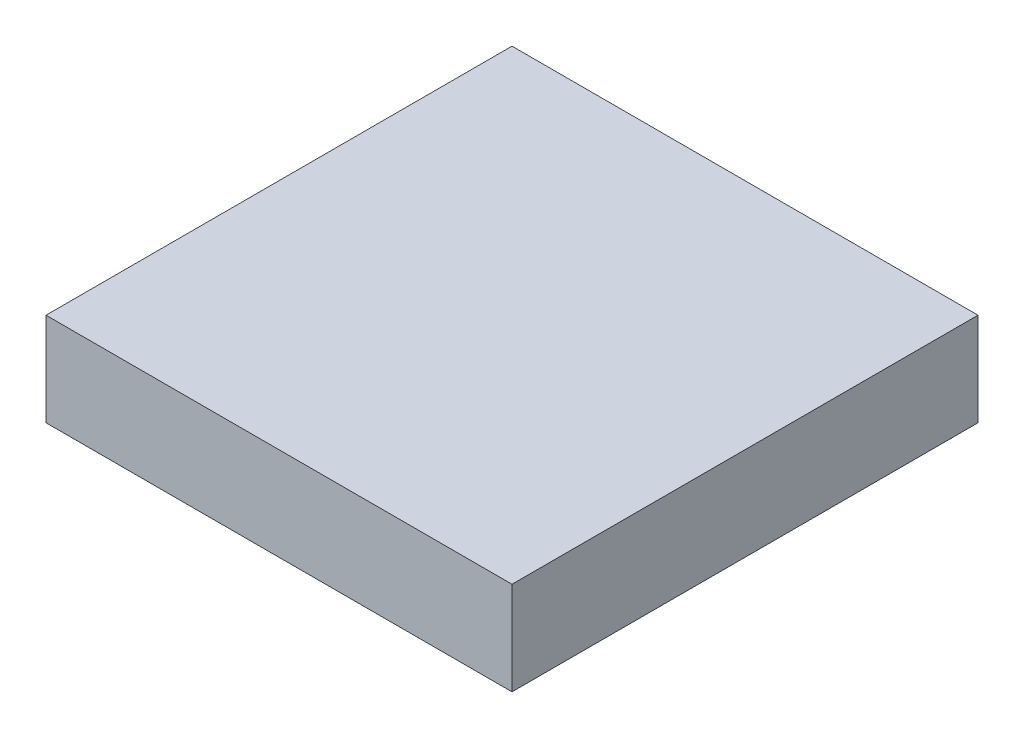
ISO-10303-21;
HEADER;
FILE_DESCRIPTION(('STEP AP214'),'2;1');
FILE_NAME('part.step','',(''),(''),'','','');
FILE_SCHEMA(('AUTOMOTIVE_DESIGN { 1 0 10303 214 1 1 1 1 }'));
ENDSEC;
DATA;
#1=APPLICATION_CONTEXT('core data for automotive mechanical design processes');
#2=APPLICATION_PROTOCOL_DEFINITION('international standard','automotive_design',2000,#1);
#3=PRODUCT_CONTEXT('',#1,'mechanical');
#4=PRODUCT('Part','Part','',(#3));
#5=PRODUCT_RELATED_PRODUCT_CATEGORY('part','',(#4));
#6=PRODUCT_DEFINITION_FORMATION('','',#4);
#7=PRODUCT_DEFINITION_CONTEXT('part definition',#1,'design');
#8=PRODUCT_DEFINITION('design','',#6,#7);
#9=PRODUCT_DEFINITION_SHAPE('','',#8);
#10=(LENGTH_UNIT() NAMED_UNIT(*) SI_UNIT(.MILLI.,.METRE.));
#11=(NAMED_UNIT(*) PLANE_ANGLE_UNIT() SI_UNIT($,.RADIAN.));
#12=(NAMED_UNIT(*) SI_UNIT($,.STERADIAN.) SOLID_ANGLE_UNIT());
#13=UNCERTAINTY_MEASURE_WITH_UNIT(LENGTH_MEASURE(1.E-05),#10,'distance_accuracy_value','');
#14=(GEOMETRIC_REPRESENTATION_CONTEXT(3) GLOBAL_UNCERTAINTY_ASSIGNED_CONTEXT((#13)) GLOBAL_UNIT_ASSIGNED_CONTEXT((#10,
#11,#12)) REPRESENTATION_CONTEXT('',''));
#15=CARTESIAN_POINT('',(0.,0.,0.));
#16=DIRECTION('',(0.,0.,1.));
#17=DIRECTION('',(1.,0.,0.));
#18=AXIS2_PLACEMENT_3D('',#15,#16,#17);
#19=CARTESIAN_POINT('',(-63.5,25.4,-63.5));
#20=DIRECTION('',(1.,0.,0.));
#21=DIRECTION('',(0.,0.,-1.));
#22=AXIS2_PLACEMENT_3D('',#19,#20,#21);
#23=PLANE('',#22);
#24=DIRECTION('',(0.,0.,1.));
#25=VECTOR('',#24,1.);
#26=CARTESIAN_POINT('',(-63.5,0.,-63.5));
#27=LINE('',#26,#25);
#28=CARTESIAN_POINT('',(-63.5,0.,-63.5));
#29=VERTEX_POINT('',#28);
#30=CARTESIAN_POINT('',(-63.5,0.,63.5));
#31=VERTEX_POINT('',#30);
#32=EDGE_CURVE('E95',#29,#31,#27,.T.);
#33=ORIENTED_EDGE('',*,*,#32,.T.);
#34=DIRECTION('',(0.,-1.,0.));
#35=VECTOR('',#34,1.);
#36=CARTESIAN_POINT('',(-63.5,25.4,63.5));
#37=LINE('',#36,#35);
#38=CARTESIAN_POINT('',(-63.5,25.4,63.5));
#39=VERTEX_POINT('',#38);
#40=EDGE_CURVE('E11',#39,#31,#37,.T.);
#41=ORIENTED_EDGE('',*,*,#40,.F.);
#42=DIRECTION('',(0.,0.,1.));
#43=VECTOR('',#42,1.);
#44=CARTESIAN_POINT('',(-63.5,25.4,-63.5));
#45=LINE('',#44,#43);
#46=CARTESIAN_POINT('',(-63.5,25.4,-63.5));
#47=VERTEX_POINT('',#46);
#48=EDGE_CURVE('E83',#47,#39,#45,.T.);
#49=ORIENTED_EDGE('',*,*,#48,.F.);
#50=DIRECTION('',(0.,-1.,0.));
#51=VECTOR('',#50,1.);
#52=CARTESIAN_POINT('',(-63.5,25.4,-63.5));
#53=LINE('',#52,#51);
#54=EDGE_CURVE('E91',#47,#29,#53,.T.);
#55=ORIENTED_EDGE('',*,*,#54,.T.);
#56=EDGE_LOOP('',(#33,#41,#49,#55));
#57=FACE_BOUND('',#56,.T.);
#58=ADVANCED_FACE('F32',(#57),#23,.F.);
#59=CARTESIAN_POINT('',(63.5,25.4,63.5));
#60=DIRECTION('',(0.,0.,-1.));
#61=DIRECTION('',(-1.,0.,0.));
#62=AXIS2_PLACEMENT_3D('',#59,#60,#61);
#63=PLANE('',#62);
#64=DIRECTION('',(1.,0.,0.));
#65=VECTOR('',#64,1.);
#66=CARTESIAN_POINT('',(63.5,0.,63.5));
#67=LINE('',#66,#65);
#68=CARTESIAN_POINT('',(63.5,0.,63.5));
#69=VERTEX_POINT('',#68);
#70=EDGE_CURVE('E87',#31,#69,#67,.T.);
#71=ORIENTED_EDGE('',*,*,#70,.T.);
#72=DIRECTION('',(0.,-1.,0.));
#73=VECTOR('',#72,1.);
#74=CARTESIAN_POINT('',(63.5,25.4,63.5));
#75=LINE('',#74,#73);
#76=CARTESIAN_POINT('',(63.5,25.4,63.5));
#77=VERTEX_POINT('',#76);
#78=EDGE_CURVE('E40',#77,#69,#75,.T.);
#79=ORIENTED_EDGE('',*,*,#78,.F.);
#80=DIRECTION('',(1.,0.,0.));
#81=VECTOR('',#80,1.);
#82=CARTESIAN_POINT('',(63.5,25.4,63.5));
#83=LINE('',#82,#81);
#84=EDGE_CURVE('E78',#39,#77,#83,.T.);
#85=ORIENTED_EDGE('',*,*,#84,.F.);
#86=ORIENTED_EDGE('',*,*,#40,.T.);
#87=EDGE_LOOP('',(#71,#79,#85,#86));
#88=FACE_BOUND('',#87,.T.);
#89=ADVANCED_FACE('F86',(#88),#63,.F.);
#90=CARTESIAN_POINT('',(63.5,25.4,-63.5));
#91=DIRECTION('',(-1.,0.,0.));
#92=DIRECTION('',(0.,0.,1.));
#93=AXIS2_PLACEMENT_3D('',#90,#91,#92);
#94=PLANE('',#93);
#95=DIRECTION('',(0.,0.,-1.));
#96=VECTOR('',#95,1.);
#97=CARTESIAN_POINT('',(63.5,0.,-63.5));
#98=LINE('',#97,#96);
#99=CARTESIAN_POINT('',(63.5,0.,-63.5));
#100=VERTEX_POINT('',#99);
#101=EDGE_CURVE('E65',#69,#100,#98,.T.);
#102=ORIENTED_EDGE('',*,*,#101,.T.);
#103=DIRECTION('',(0.,-1.,0.));
#104=VECTOR('',#103,1.);
#105=CARTESIAN_POINT('',(63.5,25.4,-63.5));
#106=LINE('',#105,#104);
#107=CARTESIAN_POINT('',(63.5,25.4,-63.5));
#108=VERTEX_POINT('',#107);
#109=EDGE_CURVE('E88',#108,#100,#106,.T.);
#110=ORIENTED_EDGE('',*,*,#109,.F.);
#111=DIRECTION('',(0.,0.,-1.));
#112=VECTOR('',#111,1.);
#113=CARTESIAN_POINT('',(63.5,25.4,-63.5));
#114=LINE('',#113,#112);
#115=EDGE_CURVE('E81',#77,#108,#114,.T.);
#116=ORIENTED_EDGE('',*,*,#115,.F.);
#117=ORIENTED_EDGE('',*,*,#78,.T.);
#118=EDGE_LOOP('',(#102,#110,#116,#117));
#119=FACE_BOUND('',#118,.T.);
#120=ADVANCED_FACE('F89',(#119),#94,.F.);
#121=CARTESIAN_POINT('',(63.5,25.4,-63.5));
#122=DIRECTION('',(0.,0.,1.));
#123=DIRECTION('',(1.,0.,0.));
#124=AXIS2_PLACEMENT_3D('',#121,#122,#123);
#125=PLANE('',#124);
#126=DIRECTION('',(-1.,0.,0.));
#127=VECTOR('',#126,1.);
#128=CARTESIAN_POINT('',(63.5,0.,-63.5));
#129=LINE('',#128,#127);
#130=EDGE_CURVE('E71',#100,#29,#129,.T.);
#131=ORIENTED_EDGE('',*,*,#130,.T.);
#132=ORIENTED_EDGE('',*,*,#54,.F.);
#133=DIRECTION('',(-1.,0.,0.));
#134=VECTOR('',#133,1.);
#135=CARTESIAN_POINT('',(63.5,25.4,-63.5));
#136=LINE('',#135,#134);
#137=EDGE_CURVE('E48',#108,#47,#136,.T.);
#138=ORIENTED_EDGE('',*,*,#137,.F.);
#139=ORIENTED_EDGE('',*,*,#109,.T.);
#140=EDGE_LOOP('',(#131,#132,#138,#139));
#141=FACE_BOUND('',#140,.T.);
#142=ADVANCED_FACE('F102',(#141),#125,.F.);
#143=CARTESIAN_POINT('',(0.,25.4,0.));
#144=DIRECTION('',(0.,-1.,0.));
#145=DIRECTION('',(0.,0.,-1.));
#146=AXIS2_PLACEMENT_3D('',#143,#144,#145);
#147=PLANE('',#146);
#148=ORIENTED_EDGE('',*,*,#48,.T.);
#149=ORIENTED_EDGE('',*,*,#84,.T.);
#150=ORIENTED_EDGE('',*,*,#115,.T.);
#151=ORIENTED_EDGE('',*,*,#137,.T.);
#152=EDGE_LOOP('',(#148,#149,#150,#151));
#153=FACE_BOUND('',#152,.T.);
#154=ADVANCED_FACE('F79',(#153),#147,.F.);
#155=CARTESIAN_POINT('',(0.,0.,0.));
#156=DIRECTION('',(0.,-1.,0.));
#157=DIRECTION('',(0.,0.,-1.));
#158=AXIS2_PLACEMENT_3D('',#155,#156,#157);
#159=PLANE('',#158);
#160=ORIENTED_EDGE('',*,*,#32,.F.);
#161=ORIENTED_EDGE('',*,*,#130,.F.);
#162=ORIENTED_EDGE('',*,*,#101,.F.);
#163=ORIENTED_EDGE('',*,*,#70,.F.);
#164=EDGE_LOOP('',(#160,#161,#162,#163));
#165=FACE_BOUND('',#164,.T.);
#166=ADVANCED_FACE('F105',(#165),#159,.T.);
#167=CLOSED_SHELL('',(#58,#89,#120,#142,#154,#166));
#168=MANIFOLD_SOLID_BREP('B2',#167);
#169=ADVANCED_BREP_SHAPE_REPRESENTATION('',(#18,#168),#14);
#170=SHAPE_DEFINITION_REPRESENTATION(#9,#169);
ENDSEC;
END-ISO-10303-21;
